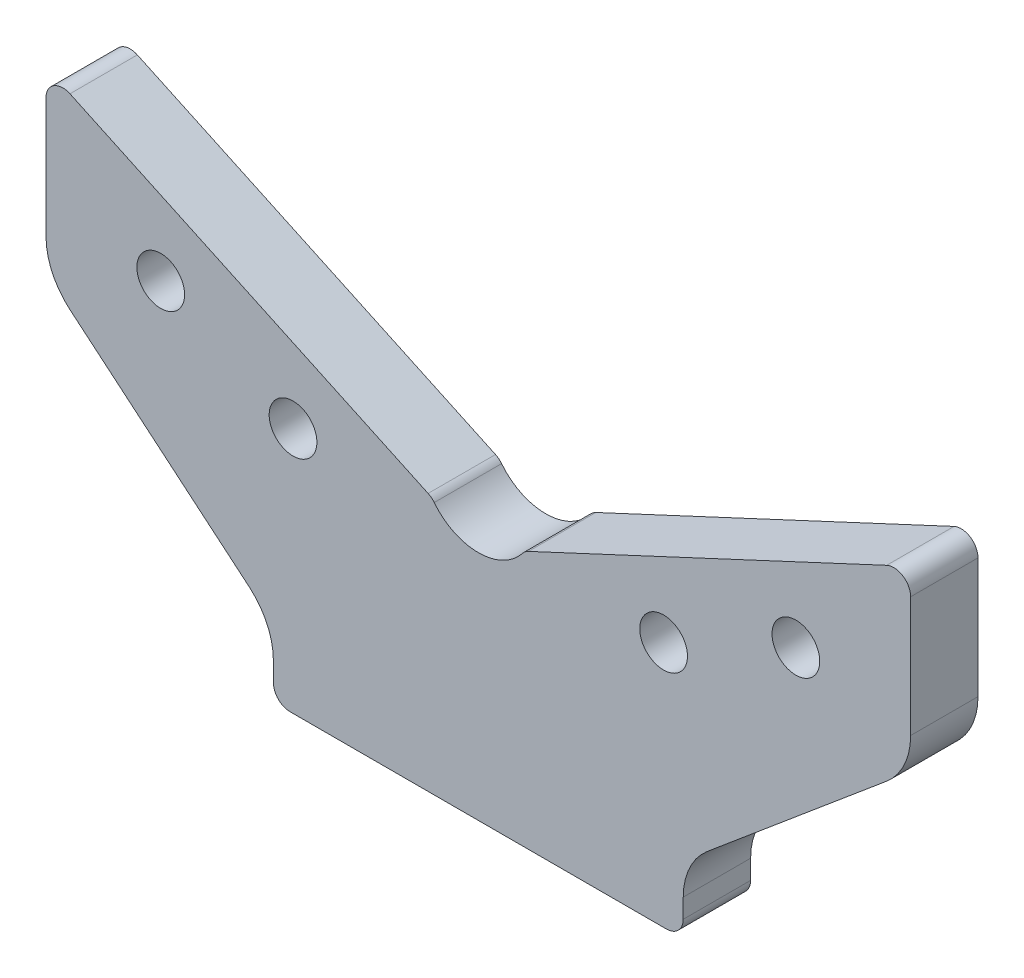
ISO-10303-21;
HEADER;
FILE_DESCRIPTION(('STEP AP214'),'2;1');
FILE_NAME('part.step','',(''),(''),'','','');
FILE_SCHEMA(('AUTOMOTIVE_DESIGN { 1 0 10303 214 1 1 1 1 }'));
ENDSEC;
DATA;
#1=APPLICATION_CONTEXT('core data for automotive mechanical design processes');
#2=APPLICATION_PROTOCOL_DEFINITION('international standard','automotive_design',2000,#1);
#3=PRODUCT_CONTEXT('',#1,'mechanical');
#4=PRODUCT('Part','Part','',(#3));
#5=PRODUCT_RELATED_PRODUCT_CATEGORY('part','',(#4));
#6=PRODUCT_DEFINITION_FORMATION('','',#4);
#7=PRODUCT_DEFINITION_CONTEXT('part definition',#1,'design');
#8=PRODUCT_DEFINITION('design','',#6,#7);
#9=PRODUCT_DEFINITION_SHAPE('','',#8);
#10=(LENGTH_UNIT() NAMED_UNIT(*) SI_UNIT(.MILLI.,.METRE.));
#11=(NAMED_UNIT(*) PLANE_ANGLE_UNIT() SI_UNIT($,.RADIAN.));
#12=(NAMED_UNIT(*) SI_UNIT($,.STERADIAN.) SOLID_ANGLE_UNIT());
#13=UNCERTAINTY_MEASURE_WITH_UNIT(LENGTH_MEASURE(1.E-05),#10,'distance_accuracy_value','');
#14=(GEOMETRIC_REPRESENTATION_CONTEXT(3) GLOBAL_UNCERTAINTY_ASSIGNED_CONTEXT((#13)) GLOBAL_UNIT_ASSIGNED_CONTEXT((#10,
#11,#12)) REPRESENTATION_CONTEXT('',''));
#15=CARTESIAN_POINT('',(0.,0.,0.));
#16=DIRECTION('',(0.,0.,1.));
#17=DIRECTION('',(1.,0.,0.));
#18=AXIS2_PLACEMENT_3D('',#15,#16,#17);
#19=CARTESIAN_POINT('',(0.,0.,12.));
#20=DIRECTION('',(0.,1.,0.));
#21=DIRECTION('',(-1.,0.,0.));
#22=AXIS2_PLACEMENT_3D('',#19,#20,#21);
#23=PLANE('',#22);
#24=DIRECTION('',(1.,0.,0.));
#25=VECTOR('',#24,1.);
#26=CARTESIAN_POINT('',(0.,0.,0.));
#27=LINE('',#26,#25);
#28=CARTESIAN_POINT('',(-33.5,0.,0.));
#29=VERTEX_POINT('',#28);
#30=CARTESIAN_POINT('',(33.5,0.,0.));
#31=VERTEX_POINT('',#30);
#32=EDGE_CURVE('E137',#29,#31,#27,.T.);
#33=ORIENTED_EDGE('',*,*,#32,.T.);
#34=DIRECTION('',(0.,0.,-1.));
#35=VECTOR('',#34,1.);
#36=CARTESIAN_POINT('',(33.5,0.,12.));
#37=LINE('',#36,#35);
#38=CARTESIAN_POINT('',(33.5,0.,12.));
#39=VERTEX_POINT('',#38);
#40=EDGE_CURVE('E11',#39,#31,#37,.T.);
#41=ORIENTED_EDGE('',*,*,#40,.F.);
#42=DIRECTION('',(1.,0.,0.));
#43=VECTOR('',#42,1.);
#44=CARTESIAN_POINT('',(0.,0.,12.));
#45=LINE('',#44,#43);
#46=CARTESIAN_POINT('',(-33.5,0.,12.));
#47=VERTEX_POINT('',#46);
#48=EDGE_CURVE('E143',#47,#39,#45,.T.);
#49=ORIENTED_EDGE('',*,*,#48,.F.);
#50=DIRECTION('',(0.,0.,-1.));
#51=VECTOR('',#50,1.);
#52=CARTESIAN_POINT('',(-33.5,0.,12.));
#53=LINE('',#52,#51);
#54=EDGE_CURVE('E213',#47,#29,#53,.T.);
#55=ORIENTED_EDGE('',*,*,#54,.T.);
#56=EDGE_LOOP('',(#33,#41,#49,#55));
#57=FACE_BOUND('',#56,.T.);
#58=ADVANCED_FACE('F47',(#57),#23,.F.);
#59=CARTESIAN_POINT('',(33.5,3.,12.));
#60=DIRECTION('',(0.,0.,-1.));
#61=DIRECTION('',(-1.,0.,0.));
#62=AXIS2_PLACEMENT_3D('',#59,#60,#61);
#63=CYLINDRICAL_SURFACE('',#62,3.);
#64=CARTESIAN_POINT('',(33.5,3.,0.));
#65=DIRECTION('',(0.,0.,1.));
#66=DIRECTION('',(-1.,0.,0.));
#67=AXIS2_PLACEMENT_3D('',#64,#65,#66);
#68=CIRCLE('',#67,3.);
#69=CARTESIAN_POINT('',(36.5,3.00000000000002,0.));
#70=VERTEX_POINT('',#69);
#71=EDGE_CURVE('E218',#31,#70,#68,.T.);
#72=ORIENTED_EDGE('',*,*,#71,.T.);
#73=DIRECTION('',(0.,0.,-1.));
#74=VECTOR('',#73,1.);
#75=CARTESIAN_POINT('',(36.5,3.00000000000002,12.));
#76=LINE('',#75,#74);
#77=CARTESIAN_POINT('',(36.5,3.00000000000002,12.));
#78=VERTEX_POINT('',#77);
#79=EDGE_CURVE('E56',#78,#70,#76,.T.);
#80=ORIENTED_EDGE('',*,*,#79,.F.);
#81=CARTESIAN_POINT('',(33.5,3.,12.));
#82=DIRECTION('',(0.,0.,1.));
#83=DIRECTION('',(-1.,0.,0.));
#84=AXIS2_PLACEMENT_3D('',#81,#82,#83);
#85=CIRCLE('',#84,3.);
#86=EDGE_CURVE('E327',#39,#78,#85,.T.);
#87=ORIENTED_EDGE('',*,*,#86,.F.);
#88=ORIENTED_EDGE('',*,*,#40,.T.);
#89=EDGE_LOOP('',(#72,#80,#87,#88));
#90=FACE_BOUND('',#89,.T.);
#91=ADVANCED_FACE('F373',(#90),#63,.T.);
#92=CARTESIAN_POINT('',(36.5,6.42077303946028,12.));
#93=DIRECTION('',(-1.,0.,0.));
#94=DIRECTION('',(0.,0.,1.));
#95=AXIS2_PLACEMENT_3D('',#92,#93,#94);
#96=PLANE('',#95);
#97=DIRECTION('',(0.,1.,0.));
#98=VECTOR('',#97,1.);
#99=CARTESIAN_POINT('',(36.5,6.42077303946028,0.));
#100=LINE('',#99,#98);
#101=CARTESIAN_POINT('',(36.5,6.42077303946028,0.));
#102=VERTEX_POINT('',#101);
#103=EDGE_CURVE('E221',#70,#102,#100,.T.);
#104=ORIENTED_EDGE('',*,*,#103,.T.);
#105=DIRECTION('',(0.,0.,-1.));
#106=VECTOR('',#105,1.);
#107=CARTESIAN_POINT('',(36.5,6.42077303946028,12.));
#108=LINE('',#107,#106);
#109=CARTESIAN_POINT('',(36.5,6.42077303946028,12.));
#110=VERTEX_POINT('',#109);
#111=EDGE_CURVE('E298',#110,#102,#108,.T.);
#112=ORIENTED_EDGE('',*,*,#111,.F.);
#113=DIRECTION('',(0.,1.,0.));
#114=VECTOR('',#113,1.);
#115=CARTESIAN_POINT('',(36.5,6.42077303946028,12.));
#116=LINE('',#115,#114);
#117=EDGE_CURVE('E329',#78,#110,#116,.T.);
#118=ORIENTED_EDGE('',*,*,#117,.F.);
#119=ORIENTED_EDGE('',*,*,#79,.T.);
#120=EDGE_LOOP('',(#104,#112,#118,#119));
#121=FACE_BOUND('',#120,.T.);
#122=ADVANCED_FACE('F379',(#121),#96,.F.);
#123=CARTESIAN_POINT('',(48.5,6.42077303946028,12.));
#124=DIRECTION('',(0.,0.,-1.));
#125=DIRECTION('',(-1.,0.,0.));
#126=AXIS2_PLACEMENT_3D('',#123,#124,#125);
#127=CYLINDRICAL_SURFACE('',#126,12.);
#128=CARTESIAN_POINT('',(48.5,6.42077303946028,0.));
#129=DIRECTION('',(0.,0.,-1.));
#130=DIRECTION('',(1.,0.,0.));
#131=AXIS2_PLACEMENT_3D('',#128,#129,#130);
#132=CIRCLE('',#131,12.);
#133=CARTESIAN_POINT('',(40.7865486837615,15.613306356888,0.));
#134=VERTEX_POINT('',#133);
#135=EDGE_CURVE('E223',#102,#134,#132,.T.);
#136=ORIENTED_EDGE('',*,*,#135,.T.);
#137=DIRECTION('',(0.,0.,-1.));
#138=VECTOR('',#137,1.);
#139=CARTESIAN_POINT('',(40.7865486837615,15.613306356888,12.));
#140=LINE('',#139,#138);
#141=CARTESIAN_POINT('',(40.7865486837615,15.613306356888,12.));
#142=VERTEX_POINT('',#141);
#143=EDGE_CURVE('E295',#142,#134,#140,.T.);
#144=ORIENTED_EDGE('',*,*,#143,.F.);
#145=CARTESIAN_POINT('',(48.5,6.42077303946028,12.));
#146=DIRECTION('',(0.,0.,-1.));
#147=DIRECTION('',(1.,0.,0.));
#148=AXIS2_PLACEMENT_3D('',#145,#146,#147);
#149=CIRCLE('',#148,12.);
#150=EDGE_CURVE('E331',#110,#142,#149,.T.);
#151=ORIENTED_EDGE('',*,*,#150,.F.);
#152=ORIENTED_EDGE('',*,*,#111,.T.);
#153=EDGE_LOOP('',(#136,#144,#151,#152));
#154=FACE_BOUND('',#153,.T.);
#155=ADVANCED_FACE('F383',(#154),#127,.F.);
#156=CARTESIAN_POINT('',(40.7865486837615,15.613306356888,12.));
#157=DIRECTION('',(-0.642787609686538,0.766044443118979,0.));
#158=DIRECTION('',(-0.766044443118979,-0.642787609686538,0.));
#159=AXIS2_PLACEMENT_3D('',#156,#157,#158);
#160=PLANE('',#159);
#161=DIRECTION('',(0.766044443118979,0.642787609686538,0.));
#162=VECTOR('',#161,1.);
#163=CARTESIAN_POINT('',(40.7865486837615,15.613306356888,0.));
#164=LINE('',#163,#162);
#165=CARTESIAN_POINT('',(72.7134513162385,42.4031585804323,0.));
#166=VERTEX_POINT('',#165);
#167=EDGE_CURVE('E225',#134,#166,#164,.T.);
#168=ORIENTED_EDGE('',*,*,#167,.T.);
#169=DIRECTION('',(0.,0.,-1.));
#170=VECTOR('',#169,1.);
#171=CARTESIAN_POINT('',(72.7134513162385,42.4031585804323,12.));
#172=LINE('',#171,#170);
#173=CARTESIAN_POINT('',(72.7134513162385,42.4031585804323,12.));
#174=VERTEX_POINT('',#173);
#175=EDGE_CURVE('E292',#174,#166,#172,.T.);
#176=ORIENTED_EDGE('',*,*,#175,.F.);
#177=DIRECTION('',(0.766044443118979,0.642787609686538,0.));
#178=VECTOR('',#177,1.);
#179=CARTESIAN_POINT('',(40.7865486837615,15.613306356888,12.));
#180=LINE('',#179,#178);
#181=EDGE_CURVE('E333',#142,#174,#180,.T.);
#182=ORIENTED_EDGE('',*,*,#181,.F.);
#183=ORIENTED_EDGE('',*,*,#143,.T.);
#184=EDGE_LOOP('',(#168,#176,#182,#183));
#185=FACE_BOUND('',#184,.T.);
#186=ADVANCED_FACE('F388',(#185),#160,.F.);
#187=CARTESIAN_POINT('',(65.,51.59569189786,12.));
#188=DIRECTION('',(0.,0.,-1.));
#189=DIRECTION('',(-1.,0.,0.));
#190=AXIS2_PLACEMENT_3D('',#187,#188,#189);
#191=CYLINDRICAL_SURFACE('',#190,12.);
#192=CARTESIAN_POINT('',(65.,51.59569189786,0.));
#193=DIRECTION('',(0.,0.,1.));
#194=DIRECTION('',(1.,0.,0.));
#195=AXIS2_PLACEMENT_3D('',#192,#193,#194);
#196=CIRCLE('',#195,12.);
#197=CARTESIAN_POINT('',(77.,51.59569189786,0.));
#198=VERTEX_POINT('',#197);
#199=EDGE_CURVE('E227',#166,#198,#196,.T.);
#200=ORIENTED_EDGE('',*,*,#199,.T.);
#201=DIRECTION('',(0.,0.,-1.));
#202=VECTOR('',#201,1.);
#203=CARTESIAN_POINT('',(77.,51.59569189786,12.));
#204=LINE('',#203,#202);
#205=CARTESIAN_POINT('',(77.,51.59569189786,12.));
#206=VERTEX_POINT('',#205);
#207=EDGE_CURVE('E289',#206,#198,#204,.T.);
#208=ORIENTED_EDGE('',*,*,#207,.F.);
#209=CARTESIAN_POINT('',(65.,51.59569189786,12.));
#210=DIRECTION('',(0.,0.,1.));
#211=DIRECTION('',(1.,0.,0.));
#212=AXIS2_PLACEMENT_3D('',#209,#210,#211);
#213=CIRCLE('',#212,12.);
#214=EDGE_CURVE('E335',#174,#206,#213,.T.);
#215=ORIENTED_EDGE('',*,*,#214,.F.);
#216=ORIENTED_EDGE('',*,*,#175,.T.);
#217=EDGE_LOOP('',(#200,#208,#215,#216));
#218=FACE_BOUND('',#217,.T.);
#219=ADVANCED_FACE('F394',(#218),#191,.T.);
#220=CARTESIAN_POINT('',(77.,51.59569189786,12.));
#221=DIRECTION('',(-1.,0.,0.));
#222=DIRECTION('',(0.,0.,1.));
#223=AXIS2_PLACEMENT_3D('',#220,#221,#222);
#224=PLANE('',#223);
#225=DIRECTION('',(0.,1.,0.));
#226=VECTOR('',#225,1.);
#227=CARTESIAN_POINT('',(77.,51.59569189786,0.));
#228=LINE('',#227,#226);
#229=CARTESIAN_POINT('',(77.,73.,0.));
#230=VERTEX_POINT('',#229);
#231=EDGE_CURVE('E229',#198,#230,#228,.T.);
#232=ORIENTED_EDGE('',*,*,#231,.T.);
#233=DIRECTION('',(0.,0.,-1.));
#234=VECTOR('',#233,1.);
#235=CARTESIAN_POINT('',(77.,73.,12.));
#236=LINE('',#235,#234);
#237=CARTESIAN_POINT('',(77.,73.,12.));
#238=VERTEX_POINT('',#237);
#239=EDGE_CURVE('E286',#238,#230,#236,.T.);
#240=ORIENTED_EDGE('',*,*,#239,.F.);
#241=DIRECTION('',(0.,1.,0.));
#242=VECTOR('',#241,1.);
#243=CARTESIAN_POINT('',(77.,51.59569189786,12.));
#244=LINE('',#243,#242);
#245=EDGE_CURVE('E337',#206,#238,#244,.T.);
#246=ORIENTED_EDGE('',*,*,#245,.F.);
#247=ORIENTED_EDGE('',*,*,#207,.T.);
#248=EDGE_LOOP('',(#232,#240,#246,#247));
#249=FACE_BOUND('',#248,.T.);
#250=ADVANCED_FACE('F398',(#249),#224,.F.);
#251=CARTESIAN_POINT('',(74.,73.,12.));
#252=DIRECTION('',(0.,0.,-1.));
#253=DIRECTION('',(-1.,0.,0.));
#254=AXIS2_PLACEMENT_3D('',#251,#252,#253);
#255=CYLINDRICAL_SURFACE('',#254,3.);
#256=CARTESIAN_POINT('',(74.,73.,0.));
#257=DIRECTION('',(0.,0.,1.));
#258=DIRECTION('',(-1.,0.,0.));
#259=AXIS2_PLACEMENT_3D('',#256,#257,#258);
#260=CIRCLE('',#259,3.);
#261=CARTESIAN_POINT('',(72.7321452147779,75.7189233611099,0.));
#262=VERTEX_POINT('',#261);
#263=EDGE_CURVE('E231',#230,#262,#260,.T.);
#264=ORIENTED_EDGE('',*,*,#263,.T.);
#265=DIRECTION('',(0.,0.,-1.));
#266=VECTOR('',#265,1.);
#267=CARTESIAN_POINT('',(72.7321452147779,75.7189233611099,12.));
#268=LINE('',#267,#266);
#269=CARTESIAN_POINT('',(72.7321452147779,75.7189233611099,12.));
#270=VERTEX_POINT('',#269);
#271=EDGE_CURVE('E283',#270,#262,#268,.T.);
#272=ORIENTED_EDGE('',*,*,#271,.F.);
#273=CARTESIAN_POINT('',(74.,73.,12.));
#274=DIRECTION('',(0.,0.,1.));
#275=DIRECTION('',(-1.,0.,0.));
#276=AXIS2_PLACEMENT_3D('',#273,#274,#275);
#277=CIRCLE('',#276,3.);
#278=EDGE_CURVE('E339',#238,#270,#277,.T.);
#279=ORIENTED_EDGE('',*,*,#278,.F.);
#280=ORIENTED_EDGE('',*,*,#239,.T.);
#281=EDGE_LOOP('',(#264,#272,#279,#280));
#282=FACE_BOUND('',#281,.T.);
#283=ADVANCED_FACE('F403',(#282),#255,.T.);
#284=CARTESIAN_POINT('',(72.7321452147779,75.7189233611099,12.));
#285=DIRECTION('',(0.422618261740705,-0.906307787036648,0.));
#286=DIRECTION('',(0.906307787036648,0.422618261740705,0.));
#287=AXIS2_PLACEMENT_3D('',#284,#285,#286);
#288=PLANE('',#287);
#289=DIRECTION('',(-0.906307787036647,-0.422618261740705,0.));
#290=VECTOR('',#289,1.);
#291=CARTESIAN_POINT('',(72.7321452147779,75.7189233611099,0.));
#292=LINE('',#291,#290);
#293=CARTESIAN_POINT('',(8.93961735786246,45.9719790883638,0.));
#294=VERTEX_POINT('',#293);
#295=EDGE_CURVE('E233',#262,#294,#292,.T.);
#296=ORIENTED_EDGE('',*,*,#295,.T.);
#297=DIRECTION('',(0.,0.,-1.));
#298=VECTOR('',#297,1.);
#299=CARTESIAN_POINT('',(8.93961735786246,45.9719790883638,12.));
#300=LINE('',#299,#298);
#301=CARTESIAN_POINT('',(8.93961735786246,45.9719790883638,12.));
#302=VERTEX_POINT('',#301);
#303=EDGE_CURVE('E280',#302,#294,#300,.T.);
#304=ORIENTED_EDGE('',*,*,#303,.F.);
#305=DIRECTION('',(-0.906307787036647,-0.422618261740705,0.));
#306=VECTOR('',#305,1.);
#307=CARTESIAN_POINT('',(72.7321452147779,75.7189233611099,12.));
#308=LINE('',#307,#306);
#309=EDGE_CURVE('E341',#270,#302,#308,.T.);
#310=ORIENTED_EDGE('',*,*,#309,.F.);
#311=ORIENTED_EDGE('',*,*,#271,.T.);
#312=EDGE_LOOP('',(#296,#304,#310,#311));
#313=FACE_BOUND('',#312,.T.);
#314=ADVANCED_FACE('F409',(#313),#288,.F.);
#315=CARTESIAN_POINT('',(10.2074721430846,43.2530557272538,12.));
#316=DIRECTION('',(0.,0.,-1.));
#317=DIRECTION('',(-1.,0.,0.));
#318=AXIS2_PLACEMENT_3D('',#315,#316,#317);
#319=CYLINDRICAL_SURFACE('',#318,3.00000000000001);
#320=CARTESIAN_POINT('',(10.2074721430846,43.2530557272538,0.));
#321=DIRECTION('',(0.,0.,1.));
#322=DIRECTION('',(-1.,0.,0.));
#323=AXIS2_PLACEMENT_3D('',#320,#321,#322);
#324=CIRCLE('',#323,3.00000000000001);
#325=CARTESIAN_POINT('',(7.85190164852659,45.1108198794453,0.));
#326=VERTEX_POINT('',#325);
#327=EDGE_CURVE('E235',#294,#326,#324,.T.);
#328=ORIENTED_EDGE('',*,*,#327,.T.);
#329=DIRECTION('',(0.,0.,-1.));
#330=VECTOR('',#329,1.);
#331=CARTESIAN_POINT('',(7.85190164852659,45.1108198794453,12.));
#332=LINE('',#331,#330);
#333=CARTESIAN_POINT('',(7.85190164852659,45.1108198794453,12.));
#334=VERTEX_POINT('',#333);
#335=EDGE_CURVE('E277',#334,#326,#332,.T.);
#336=ORIENTED_EDGE('',*,*,#335,.F.);
#337=CARTESIAN_POINT('',(10.2074721430846,43.2530557272538,12.));
#338=DIRECTION('',(0.,0.,1.));
#339=DIRECTION('',(-1.,0.,0.));
#340=AXIS2_PLACEMENT_3D('',#337,#338,#339);
#341=CIRCLE('',#340,3.00000000000001);
#342=EDGE_CURVE('E343',#302,#334,#341,.T.);
#343=ORIENTED_EDGE('',*,*,#342,.F.);
#344=ORIENTED_EDGE('',*,*,#303,.T.);
#345=EDGE_LOOP('',(#328,#336,#343,#344));
#346=FACE_BOUND('',#345,.T.);
#347=ADVANCED_FACE('F413',(#346),#319,.T.);
#348=CARTESIAN_POINT('',(0.,51.303367053417,12.));
#349=DIRECTION('',(0.,0.,-1.));
#350=DIRECTION('',(-1.,0.,0.));
#351=AXIS2_PLACEMENT_3D('',#348,#349,#350);
#352=CYLINDRICAL_SURFACE('',#351,10.);
#353=CARTESIAN_POINT('',(0.,51.303367053417,0.));
#354=DIRECTION('',(0.,0.,-1.));
#355=DIRECTION('',(1.,0.,0.));
#356=AXIS2_PLACEMENT_3D('',#353,#354,#355);
#357=CIRCLE('',#356,10.);
#358=CARTESIAN_POINT('',(-7.8519016485266,45.1108198794453,0.));
#359=VERTEX_POINT('',#358);
#360=EDGE_CURVE('E237',#326,#359,#357,.T.);
#361=ORIENTED_EDGE('',*,*,#360,.T.);
#362=DIRECTION('',(0.,0.,-1.));
#363=VECTOR('',#362,1.);
#364=CARTESIAN_POINT('',(-7.8519016485266,45.1108198794453,12.));
#365=LINE('',#364,#363);
#366=CARTESIAN_POINT('',(-7.8519016485266,45.1108198794453,12.));
#367=VERTEX_POINT('',#366);
#368=EDGE_CURVE('E274',#367,#359,#365,.T.);
#369=ORIENTED_EDGE('',*,*,#368,.F.);
#370=CARTESIAN_POINT('',(0.,51.303367053417,12.));
#371=DIRECTION('',(0.,0.,-1.));
#372=DIRECTION('',(1.,0.,0.));
#373=AXIS2_PLACEMENT_3D('',#370,#371,#372);
#374=CIRCLE('',#373,10.);
#375=EDGE_CURVE('E345',#334,#367,#374,.T.);
#376=ORIENTED_EDGE('',*,*,#375,.F.);
#377=ORIENTED_EDGE('',*,*,#335,.T.);
#378=EDGE_LOOP('',(#361,#369,#376,#377));
#379=FACE_BOUND('',#378,.T.);
#380=ADVANCED_FACE('F418',(#379),#352,.F.);
#381=CARTESIAN_POINT('',(-10.2074721430846,43.2530557272538,12.));
#382=DIRECTION('',(0.,0.,-1.));
#383=DIRECTION('',(-1.,0.,0.));
#384=AXIS2_PLACEMENT_3D('',#381,#382,#383);
#385=CYLINDRICAL_SURFACE('',#384,3.00000000000001);
#386=CARTESIAN_POINT('',(-10.2074721430846,43.2530557272538,0.));
#387=DIRECTION('',(0.,0.,1.));
#388=DIRECTION('',(1.,0.,0.));
#389=AXIS2_PLACEMENT_3D('',#386,#387,#388);
#390=CIRCLE('',#389,3.00000000000001);
#391=CARTESIAN_POINT('',(-8.93961735786246,45.9719790883637,0.));
#392=VERTEX_POINT('',#391);
#393=EDGE_CURVE('E239',#359,#392,#390,.T.);
#394=ORIENTED_EDGE('',*,*,#393,.T.);
#395=DIRECTION('',(0.,0.,-1.));
#396=VECTOR('',#395,1.);
#397=CARTESIAN_POINT('',(-8.93961735786246,45.9719790883637,12.));
#398=LINE('',#397,#396);
#399=CARTESIAN_POINT('',(-8.93961735786246,45.9719790883637,12.));
#400=VERTEX_POINT('',#399);
#401=EDGE_CURVE('E271',#400,#392,#398,.T.);
#402=ORIENTED_EDGE('',*,*,#401,.F.);
#403=CARTESIAN_POINT('',(-10.2074721430846,43.2530557272538,12.));
#404=DIRECTION('',(0.,0.,1.));
#405=DIRECTION('',(1.,0.,0.));
#406=AXIS2_PLACEMENT_3D('',#403,#404,#405);
#407=CIRCLE('',#406,3.00000000000001);
#408=EDGE_CURVE('E347',#367,#400,#407,.T.);
#409=ORIENTED_EDGE('',*,*,#408,.F.);
#410=ORIENTED_EDGE('',*,*,#368,.T.);
#411=EDGE_LOOP('',(#394,#402,#409,#410));
#412=FACE_BOUND('',#411,.T.);
#413=ADVANCED_FACE('F424',(#412),#385,.T.);
#414=CARTESIAN_POINT('',(-72.7321452147779,75.7189233611099,12.));
#415=DIRECTION('',(-0.422618261740705,-0.906307787036648,0.));
#416=DIRECTION('',(0.906307787036648,-0.422618261740705,0.));
#417=AXIS2_PLACEMENT_3D('',#414,#415,#416);
#418=PLANE('',#417);
#419=DIRECTION('',(-0.906307787036647,0.422618261740705,0.));
#420=VECTOR('',#419,1.);
#421=CARTESIAN_POINT('',(-72.7321452147779,75.7189233611099,0.));
#422=LINE('',#421,#420);
#423=CARTESIAN_POINT('',(-72.7321452147779,75.7189233611099,0.));
#424=VERTEX_POINT('',#423);
#425=EDGE_CURVE('E241',#392,#424,#422,.T.);
#426=ORIENTED_EDGE('',*,*,#425,.T.);
#427=DIRECTION('',(0.,0.,-1.));
#428=VECTOR('',#427,1.);
#429=CARTESIAN_POINT('',(-72.7321452147779,75.7189233611099,12.));
#430=LINE('',#429,#428);
#431=CARTESIAN_POINT('',(-72.7321452147779,75.7189233611099,12.));
#432=VERTEX_POINT('',#431);
#433=EDGE_CURVE('E268',#432,#424,#430,.T.);
#434=ORIENTED_EDGE('',*,*,#433,.F.);
#435=DIRECTION('',(-0.906307787036647,0.422618261740705,0.));
#436=VECTOR('',#435,1.);
#437=CARTESIAN_POINT('',(-72.7321452147779,75.7189233611099,12.));
#438=LINE('',#437,#436);
#439=EDGE_CURVE('E349',#400,#432,#438,.T.);
#440=ORIENTED_EDGE('',*,*,#439,.F.);
#441=ORIENTED_EDGE('',*,*,#401,.T.);
#442=EDGE_LOOP('',(#426,#434,#440,#441));
#443=FACE_BOUND('',#442,.T.);
#444=ADVANCED_FACE('F428',(#443),#418,.F.);
#445=CARTESIAN_POINT('',(-74.,73.,12.));
#446=DIRECTION('',(0.,0.,-1.));
#447=DIRECTION('',(-1.,0.,0.));
#448=AXIS2_PLACEMENT_3D('',#445,#446,#447);
#449=CYLINDRICAL_SURFACE('',#448,3.);
#450=CARTESIAN_POINT('',(-74.,73.,0.));
#451=DIRECTION('',(0.,0.,1.));
#452=DIRECTION('',(-1.,0.,0.));
#453=AXIS2_PLACEMENT_3D('',#450,#451,#452);
#454=CIRCLE('',#453,3.);
#455=CARTESIAN_POINT('',(-77.,73.,0.));
#456=VERTEX_POINT('',#455);
#457=EDGE_CURVE('E243',#424,#456,#454,.T.);
#458=ORIENTED_EDGE('',*,*,#457,.T.);
#459=DIRECTION('',(0.,0.,-1.));
#460=VECTOR('',#459,1.);
#461=CARTESIAN_POINT('',(-77.,73.,12.));
#462=LINE('',#461,#460);
#463=CARTESIAN_POINT('',(-77.,73.,12.));
#464=VERTEX_POINT('',#463);
#465=EDGE_CURVE('E265',#464,#456,#462,.T.);
#466=ORIENTED_EDGE('',*,*,#465,.F.);
#467=CARTESIAN_POINT('',(-74.,73.,12.));
#468=DIRECTION('',(0.,0.,1.));
#469=DIRECTION('',(-1.,0.,0.));
#470=AXIS2_PLACEMENT_3D('',#467,#468,#469);
#471=CIRCLE('',#470,3.);
#472=EDGE_CURVE('E351',#432,#464,#471,.T.);
#473=ORIENTED_EDGE('',*,*,#472,.F.);
#474=ORIENTED_EDGE('',*,*,#433,.T.);
#475=EDGE_LOOP('',(#458,#466,#473,#474));
#476=FACE_BOUND('',#475,.T.);
#477=ADVANCED_FACE('F433',(#476),#449,.T.);
#478=CARTESIAN_POINT('',(-77.,51.59569189786,12.));
#479=DIRECTION('',(1.,0.,0.));
#480=DIRECTION('',(0.,0.,-1.));
#481=AXIS2_PLACEMENT_3D('',#478,#479,#480);
#482=PLANE('',#481);
#483=DIRECTION('',(0.,-1.,0.));
#484=VECTOR('',#483,1.);
#485=CARTESIAN_POINT('',(-77.,51.59569189786,0.));
#486=LINE('',#485,#484);
#487=CARTESIAN_POINT('',(-77.,51.59569189786,0.));
#488=VERTEX_POINT('',#487);
#489=EDGE_CURVE('E245',#456,#488,#486,.T.);
#490=ORIENTED_EDGE('',*,*,#489,.T.);
#491=DIRECTION('',(0.,0.,-1.));
#492=VECTOR('',#491,1.);
#493=CARTESIAN_POINT('',(-77.,51.59569189786,12.));
#494=LINE('',#493,#492);
#495=CARTESIAN_POINT('',(-77.,51.59569189786,12.));
#496=VERTEX_POINT('',#495);
#497=EDGE_CURVE('E262',#496,#488,#494,.T.);
#498=ORIENTED_EDGE('',*,*,#497,.F.);
#499=DIRECTION('',(0.,-1.,0.));
#500=VECTOR('',#499,1.);
#501=CARTESIAN_POINT('',(-77.,51.59569189786,12.));
#502=LINE('',#501,#500);
#503=EDGE_CURVE('E353',#464,#496,#502,.T.);
#504=ORIENTED_EDGE('',*,*,#503,.F.);
#505=ORIENTED_EDGE('',*,*,#465,.T.);
#506=EDGE_LOOP('',(#490,#498,#504,#505));
#507=FACE_BOUND('',#506,.T.);
#508=ADVANCED_FACE('F436',(#507),#482,.F.);
#509=CARTESIAN_POINT('',(-65.,51.59569189786,12.));
#510=DIRECTION('',(0.,0.,-1.));
#511=DIRECTION('',(-1.,0.,0.));
#512=AXIS2_PLACEMENT_3D('',#509,#510,#511);
#513=CYLINDRICAL_SURFACE('',#512,12.);
#514=CARTESIAN_POINT('',(-65.,51.59569189786,0.));
#515=DIRECTION('',(0.,0.,1.));
#516=DIRECTION('',(-1.,0.,0.));
#517=AXIS2_PLACEMENT_3D('',#514,#515,#516);
#518=CIRCLE('',#517,12.);
#519=CARTESIAN_POINT('',(-72.7134513162385,42.4031585804322,0.));
#520=VERTEX_POINT('',#519);
#521=EDGE_CURVE('E247',#488,#520,#518,.T.);
#522=ORIENTED_EDGE('',*,*,#521,.T.);
#523=DIRECTION('',(0.,0.,-1.));
#524=VECTOR('',#523,1.);
#525=CARTESIAN_POINT('',(-72.7134513162385,42.4031585804322,12.));
#526=LINE('',#525,#524);
#527=CARTESIAN_POINT('',(-72.7134513162385,42.4031585804322,12.));
#528=VERTEX_POINT('',#527);
#529=EDGE_CURVE('E259',#528,#520,#526,.T.);
#530=ORIENTED_EDGE('',*,*,#529,.F.);
#531=CARTESIAN_POINT('',(-65.,51.59569189786,12.));
#532=DIRECTION('',(0.,0.,1.));
#533=DIRECTION('',(-1.,0.,0.));
#534=AXIS2_PLACEMENT_3D('',#531,#532,#533);
#535=CIRCLE('',#534,12.);
#536=EDGE_CURVE('E355',#496,#528,#535,.T.);
#537=ORIENTED_EDGE('',*,*,#536,.F.);
#538=ORIENTED_EDGE('',*,*,#497,.T.);
#539=EDGE_LOOP('',(#522,#530,#537,#538));
#540=FACE_BOUND('',#539,.T.);
#541=ADVANCED_FACE('F361',(#540),#513,.T.);
#542=CARTESIAN_POINT('',(-40.7865486837615,15.613306356888,12.));
#543=DIRECTION('',(0.642787609686538,0.766044443118979,0.));
#544=DIRECTION('',(-0.766044443118979,0.642787609686538,0.));
#545=AXIS2_PLACEMENT_3D('',#542,#543,#544);
#546=PLANE('',#545);
#547=DIRECTION('',(0.766044443118979,-0.642787609686538,0.));
#548=VECTOR('',#547,1.);
#549=CARTESIAN_POINT('',(-40.7865486837615,15.613306356888,0.));
#550=LINE('',#549,#548);
#551=CARTESIAN_POINT('',(-40.7865486837615,15.613306356888,0.));
#552=VERTEX_POINT('',#551);
#553=EDGE_CURVE('E249',#520,#552,#550,.T.);
#554=ORIENTED_EDGE('',*,*,#553,.T.);
#555=DIRECTION('',(0.,0.,-1.));
#556=VECTOR('',#555,1.);
#557=CARTESIAN_POINT('',(-40.7865486837615,15.613306356888,12.));
#558=LINE('',#557,#556);
#559=CARTESIAN_POINT('',(-40.7865486837615,15.613306356888,12.));
#560=VERTEX_POINT('',#559);
#561=EDGE_CURVE('E208',#560,#552,#558,.T.);
#562=ORIENTED_EDGE('',*,*,#561,.F.);
#563=DIRECTION('',(0.766044443118979,-0.642787609686538,0.));
#564=VECTOR('',#563,1.);
#565=CARTESIAN_POINT('',(-40.7865486837615,15.613306356888,12.));
#566=LINE('',#565,#564);
#567=EDGE_CURVE('E199',#528,#560,#566,.T.);
#568=ORIENTED_EDGE('',*,*,#567,.F.);
#569=ORIENTED_EDGE('',*,*,#529,.T.);
#570=EDGE_LOOP('',(#554,#562,#568,#569));
#571=FACE_BOUND('',#570,.T.);
#572=ADVANCED_FACE('F365',(#571),#546,.F.);
#573=CARTESIAN_POINT('',(-48.5,6.42077303946028,12.));
#574=DIRECTION('',(0.,0.,-1.));
#575=DIRECTION('',(-1.,0.,0.));
#576=AXIS2_PLACEMENT_3D('',#573,#574,#575);
#577=CYLINDRICAL_SURFACE('',#576,12.);
#578=CARTESIAN_POINT('',(-48.5,6.42077303946028,0.));
#579=DIRECTION('',(0.,0.,-1.));
#580=DIRECTION('',(-1.,0.,0.));
#581=AXIS2_PLACEMENT_3D('',#578,#579,#580);
#582=CIRCLE('',#581,12.);
#583=CARTESIAN_POINT('',(-36.5,6.42077303946028,0.));
#584=VERTEX_POINT('',#583);
#585=EDGE_CURVE('E207',#552,#584,#582,.T.);
#586=ORIENTED_EDGE('',*,*,#585,.T.);
#587=DIRECTION('',(0.,0.,-1.));
#588=VECTOR('',#587,1.);
#589=CARTESIAN_POINT('',(-36.5,6.42077303946028,12.));
#590=LINE('',#589,#588);
#591=CARTESIAN_POINT('',(-36.5,6.42077303946028,12.));
#592=VERTEX_POINT('',#591);
#593=EDGE_CURVE('E204',#592,#584,#590,.T.);
#594=ORIENTED_EDGE('',*,*,#593,.F.);
#595=CARTESIAN_POINT('',(-48.5,6.42077303946028,12.));
#596=DIRECTION('',(0.,0.,-1.));
#597=DIRECTION('',(-1.,0.,0.));
#598=AXIS2_PLACEMENT_3D('',#595,#596,#597);
#599=CIRCLE('',#598,12.);
#600=EDGE_CURVE('E193',#560,#592,#599,.T.);
#601=ORIENTED_EDGE('',*,*,#600,.F.);
#602=ORIENTED_EDGE('',*,*,#561,.T.);
#603=EDGE_LOOP('',(#586,#594,#601,#602));
#604=FACE_BOUND('',#603,.T.);
#605=ADVANCED_FACE('F205',(#604),#577,.F.);
#606=CARTESIAN_POINT('',(-36.5,6.42077303946028,12.));
#607=DIRECTION('',(1.,0.,0.));
#608=DIRECTION('',(0.,0.,-1.));
#609=AXIS2_PLACEMENT_3D('',#606,#607,#608);
#610=PLANE('',#609);
#611=DIRECTION('',(0.,-1.,0.));
#612=VECTOR('',#611,1.);
#613=CARTESIAN_POINT('',(-36.5,6.42077303946028,0.));
#614=LINE('',#613,#612);
#615=CARTESIAN_POINT('',(-36.5,3.00000000000002,0.));
#616=VERTEX_POINT('',#615);
#617=EDGE_CURVE('E130',#584,#616,#614,.T.);
#618=ORIENTED_EDGE('',*,*,#617,.T.);
#619=DIRECTION('',(0.,0.,-1.));
#620=VECTOR('',#619,1.);
#621=CARTESIAN_POINT('',(-36.5,3.00000000000002,12.));
#622=LINE('',#621,#620);
#623=CARTESIAN_POINT('',(-36.5,3.00000000000002,12.));
#624=VERTEX_POINT('',#623);
#625=EDGE_CURVE('E209',#624,#616,#622,.T.);
#626=ORIENTED_EDGE('',*,*,#625,.F.);
#627=DIRECTION('',(0.,-1.,0.));
#628=VECTOR('',#627,1.);
#629=CARTESIAN_POINT('',(-36.5,6.42077303946028,12.));
#630=LINE('',#629,#628);
#631=EDGE_CURVE('E197',#592,#624,#630,.T.);
#632=ORIENTED_EDGE('',*,*,#631,.F.);
#633=ORIENTED_EDGE('',*,*,#593,.T.);
#634=EDGE_LOOP('',(#618,#626,#632,#633));
#635=FACE_BOUND('',#634,.T.);
#636=ADVANCED_FACE('F211',(#635),#610,.F.);
#637=CARTESIAN_POINT('',(-33.5,2.99999999999999,12.));
#638=DIRECTION('',(0.,0.,-1.));
#639=DIRECTION('',(-1.,0.,0.));
#640=AXIS2_PLACEMENT_3D('',#637,#638,#639);
#641=CYLINDRICAL_SURFACE('',#640,3.);
#642=CARTESIAN_POINT('',(-33.5,2.99999999999999,0.));
#643=DIRECTION('',(0.,0.,1.));
#644=DIRECTION('',(1.,0.,0.));
#645=AXIS2_PLACEMENT_3D('',#642,#643,#644);
#646=CIRCLE('',#645,3.);
#647=EDGE_CURVE('E253',#616,#29,#646,.T.);
#648=ORIENTED_EDGE('',*,*,#647,.T.);
#649=ORIENTED_EDGE('',*,*,#54,.F.);
#650=CARTESIAN_POINT('',(-33.5,2.99999999999999,12.));
#651=DIRECTION('',(0.,0.,1.));
#652=DIRECTION('',(1.,0.,0.));
#653=AXIS2_PLACEMENT_3D('',#650,#651,#652);
#654=CIRCLE('',#653,3.);
#655=EDGE_CURVE('E65',#624,#47,#654,.T.);
#656=ORIENTED_EDGE('',*,*,#655,.F.);
#657=ORIENTED_EDGE('',*,*,#625,.T.);
#658=EDGE_LOOP('',(#648,#649,#656,#657));
#659=FACE_BOUND('',#658,.T.);
#660=ADVANCED_FACE('F368',(#659),#641,.T.);
#661=CARTESIAN_POINT('',(-33.5,2.99999999999999,12.));
#662=DIRECTION('',(0.,0.,1.));
#663=DIRECTION('',(1.,0.,0.));
#664=AXIS2_PLACEMENT_3D('',#661,#662,#663);
#665=PLANE('',#664);
#666=CARTESIAN_POINT('',(-33.,43.9509847449823,12.));
#667=DIRECTION('',(0.,0.,1.));
#668=DIRECTION('',(1.,0.,0.));
#669=AXIS2_PLACEMENT_3D('',#666,#667,#668);
#670=CIRCLE('',#669,4.25);
#671=CARTESIAN_POINT('',(-28.75,43.9509847449823,12.));
#672=VERTEX_POINT('',#671);
#673=EDGE_CURVE('E321',#672,#672,#670,.T.);
#674=ORIENTED_EDGE('',*,*,#673,.F.);
#675=EDGE_LOOP('',(#674));
#676=FACE_BOUND('',#675,.T.);
#677=CARTESIAN_POINT('',(-56.5640024629528,54.9390595502406,12.));
#678=DIRECTION('',(0.,0.,1.));
#679=DIRECTION('',(1.,0.,0.));
#680=AXIS2_PLACEMENT_3D('',#677,#678,#679);
#681=CIRCLE('',#680,4.25);
#682=CARTESIAN_POINT('',(-52.3140024629528,54.9390595502406,12.));
#683=VERTEX_POINT('',#682);
#684=EDGE_CURVE('E311',#683,#683,#681,.T.);
#685=ORIENTED_EDGE('',*,*,#684,.F.);
#686=EDGE_LOOP('',(#685));
#687=FACE_BOUND('',#686,.T.);
#688=CARTESIAN_POINT('',(56.5640024629528,54.9390595502406,12.));
#689=DIRECTION('',(0.,0.,1.));
#690=DIRECTION('',(1.,0.,0.));
#691=AXIS2_PLACEMENT_3D('',#688,#689,#690);
#692=CIRCLE('',#691,4.25);
#693=CARTESIAN_POINT('',(60.8140024629528,54.9390595502406,12.));
#694=VERTEX_POINT('',#693);
#695=EDGE_CURVE('E308',#694,#694,#692,.T.);
#696=ORIENTED_EDGE('',*,*,#695,.F.);
#697=EDGE_LOOP('',(#696));
#698=FACE_BOUND('',#697,.T.);
#699=CARTESIAN_POINT('',(33.,43.9509847449823,12.));
#700=DIRECTION('',(0.,0.,1.));
#701=DIRECTION('',(1.,0.,0.));
#702=AXIS2_PLACEMENT_3D('',#699,#700,#701);
#703=CIRCLE('',#702,4.25);
#704=CARTESIAN_POINT('',(37.25,43.9509847449823,12.));
#705=VERTEX_POINT('',#704);
#706=EDGE_CURVE('E305',#705,#705,#703,.T.);
#707=ORIENTED_EDGE('',*,*,#706,.F.);
#708=EDGE_LOOP('',(#707));
#709=FACE_BOUND('',#708,.T.);
#710=ORIENTED_EDGE('',*,*,#48,.T.);
#711=ORIENTED_EDGE('',*,*,#86,.T.);
#712=ORIENTED_EDGE('',*,*,#117,.T.);
#713=ORIENTED_EDGE('',*,*,#150,.T.);
#714=ORIENTED_EDGE('',*,*,#181,.T.);
#715=ORIENTED_EDGE('',*,*,#214,.T.);
#716=ORIENTED_EDGE('',*,*,#245,.T.);
#717=ORIENTED_EDGE('',*,*,#278,.T.);
#718=ORIENTED_EDGE('',*,*,#309,.T.);
#719=ORIENTED_EDGE('',*,*,#342,.T.);
#720=ORIENTED_EDGE('',*,*,#375,.T.);
#721=ORIENTED_EDGE('',*,*,#408,.T.);
#722=ORIENTED_EDGE('',*,*,#439,.T.);
#723=ORIENTED_EDGE('',*,*,#472,.T.);
#724=ORIENTED_EDGE('',*,*,#503,.T.);
#725=ORIENTED_EDGE('',*,*,#536,.T.);
#726=ORIENTED_EDGE('',*,*,#567,.T.);
#727=ORIENTED_EDGE('',*,*,#600,.T.);
#728=ORIENTED_EDGE('',*,*,#631,.T.);
#729=ORIENTED_EDGE('',*,*,#655,.T.);
#730=EDGE_LOOP('',(#710,#711,#712,#713,#714,#715,#716,#717,#718,#719,#720,#721,#722,#723,#724,
#725,#726,#727,#728,#729));
#731=FACE_BOUND('',#730,.T.);
#732=ADVANCED_FACE('F195',(#676,#687,#698,#709,#731),#665,.T.);
#733=CARTESIAN_POINT('',(-33.5,2.99999999999999,0.));
#734=DIRECTION('',(0.,0.,1.));
#735=DIRECTION('',(1.,0.,0.));
#736=AXIS2_PLACEMENT_3D('',#733,#734,#735);
#737=PLANE('',#736);
#738=CARTESIAN_POINT('',(-33.,43.9509847449823,0.));
#739=DIRECTION('',(0.,0.,1.));
#740=DIRECTION('',(1.,0.,0.));
#741=AXIS2_PLACEMENT_3D('',#738,#739,#740);
#742=CIRCLE('',#741,4.25);
#743=CARTESIAN_POINT('',(-28.75,43.9509847449823,0.));
#744=VERTEX_POINT('',#743);
#745=EDGE_CURVE('E50',#744,#744,#742,.T.);
#746=ORIENTED_EDGE('',*,*,#745,.T.);
#747=EDGE_LOOP('',(#746));
#748=FACE_BOUND('',#747,.T.);
#749=CARTESIAN_POINT('',(-56.5640024629528,54.9390595502406,0.));
#750=DIRECTION('',(0.,0.,1.));
#751=DIRECTION('',(1.,0.,0.));
#752=AXIS2_PLACEMENT_3D('',#749,#750,#751);
#753=CIRCLE('',#752,4.25);
#754=CARTESIAN_POINT('',(-52.3140024629528,54.9390595502406,0.));
#755=VERTEX_POINT('',#754);
#756=EDGE_CURVE('E309',#755,#755,#753,.T.);
#757=ORIENTED_EDGE('',*,*,#756,.T.);
#758=EDGE_LOOP('',(#757));
#759=FACE_BOUND('',#758,.T.);
#760=CARTESIAN_POINT('',(56.5640024629528,54.9390595502406,0.));
#761=DIRECTION('',(0.,0.,1.));
#762=DIRECTION('',(1.,0.,0.));
#763=AXIS2_PLACEMENT_3D('',#760,#761,#762);
#764=CIRCLE('',#763,4.25);
#765=CARTESIAN_POINT('',(60.8140024629528,54.9390595502406,0.));
#766=VERTEX_POINT('',#765);
#767=EDGE_CURVE('E306',#766,#766,#764,.T.);
#768=ORIENTED_EDGE('',*,*,#767,.T.);
#769=EDGE_LOOP('',(#768));
#770=FACE_BOUND('',#769,.T.);
#771=CARTESIAN_POINT('',(33.,43.9509847449823,0.));
#772=DIRECTION('',(0.,0.,1.));
#773=DIRECTION('',(1.,0.,0.));
#774=AXIS2_PLACEMENT_3D('',#771,#772,#773);
#775=CIRCLE('',#774,4.25);
#776=CARTESIAN_POINT('',(37.25,43.9509847449823,0.));
#777=VERTEX_POINT('',#776);
#778=EDGE_CURVE('E219',#777,#777,#775,.T.);
#779=ORIENTED_EDGE('',*,*,#778,.T.);
#780=EDGE_LOOP('',(#779));
#781=FACE_BOUND('',#780,.T.);
#782=ORIENTED_EDGE('',*,*,#32,.F.);
#783=ORIENTED_EDGE('',*,*,#647,.F.);
#784=ORIENTED_EDGE('',*,*,#617,.F.);
#785=ORIENTED_EDGE('',*,*,#585,.F.);
#786=ORIENTED_EDGE('',*,*,#553,.F.);
#787=ORIENTED_EDGE('',*,*,#521,.F.);
#788=ORIENTED_EDGE('',*,*,#489,.F.);
#789=ORIENTED_EDGE('',*,*,#457,.F.);
#790=ORIENTED_EDGE('',*,*,#425,.F.);
#791=ORIENTED_EDGE('',*,*,#393,.F.);
#792=ORIENTED_EDGE('',*,*,#360,.F.);
#793=ORIENTED_EDGE('',*,*,#327,.F.);
#794=ORIENTED_EDGE('',*,*,#295,.F.);
#795=ORIENTED_EDGE('',*,*,#263,.F.);
#796=ORIENTED_EDGE('',*,*,#231,.F.);
#797=ORIENTED_EDGE('',*,*,#199,.F.);
#798=ORIENTED_EDGE('',*,*,#167,.F.);
#799=ORIENTED_EDGE('',*,*,#135,.F.);
#800=ORIENTED_EDGE('',*,*,#103,.F.);
#801=ORIENTED_EDGE('',*,*,#71,.F.);
#802=EDGE_LOOP('',(#782,#783,#784,#785,#786,#787,#788,#789,#790,#791,#792,#793,#794,#795,#796,
#797,#798,#799,#800,#801));
#803=FACE_BOUND('',#802,.T.);
#804=ADVANCED_FACE('F366',(#748,#759,#770,#781,#803),#737,.F.);
#805=CARTESIAN_POINT('',(33.,43.9509847449823,12.));
#806=DIRECTION('',(0.,0.,1.));
#807=DIRECTION('',(1.,0.,0.));
#808=AXIS2_PLACEMENT_3D('',#805,#806,#807);
#809=CYLINDRICAL_SURFACE('',#808,4.25);
#810=ORIENTED_EDGE('',*,*,#706,.T.);
#811=EDGE_LOOP('',(#810));
#812=FACE_BOUND('',#811,.T.);
#813=ORIENTED_EDGE('',*,*,#778,.F.);
#814=EDGE_LOOP('',(#813));
#815=FACE_BOUND('',#814,.T.);
#816=ADVANCED_FACE('F525',(#812,#815),#809,.F.);
#817=CARTESIAN_POINT('',(56.5640024629528,54.9390595502406,12.));
#818=DIRECTION('',(0.,0.,1.));
#819=DIRECTION('',(1.,0.,0.));
#820=AXIS2_PLACEMENT_3D('',#817,#818,#819);
#821=CYLINDRICAL_SURFACE('',#820,4.25);
#822=ORIENTED_EDGE('',*,*,#695,.T.);
#823=EDGE_LOOP('',(#822));
#824=FACE_BOUND('',#823,.T.);
#825=ORIENTED_EDGE('',*,*,#767,.F.);
#826=EDGE_LOOP('',(#825));
#827=FACE_BOUND('',#826,.T.);
#828=ADVANCED_FACE('F534',(#824,#827),#821,.F.);
#829=CARTESIAN_POINT('',(-56.5640024629528,54.9390595502406,12.));
#830=DIRECTION('',(0.,0.,1.));
#831=DIRECTION('',(1.,0.,0.));
#832=AXIS2_PLACEMENT_3D('',#829,#830,#831);
#833=CYLINDRICAL_SURFACE('',#832,4.25);
#834=ORIENTED_EDGE('',*,*,#684,.T.);
#835=EDGE_LOOP('',(#834));
#836=FACE_BOUND('',#835,.T.);
#837=ORIENTED_EDGE('',*,*,#756,.F.);
#838=EDGE_LOOP('',(#837));
#839=FACE_BOUND('',#838,.T.);
#840=ADVANCED_FACE('F544',(#836,#839),#833,.F.);
#841=CARTESIAN_POINT('',(-33.,43.9509847449823,12.));
#842=DIRECTION('',(0.,0.,1.));
#843=DIRECTION('',(1.,0.,0.));
#844=AXIS2_PLACEMENT_3D('',#841,#842,#843);
#845=CYLINDRICAL_SURFACE('',#844,4.25);
#846=ORIENTED_EDGE('',*,*,#673,.T.);
#847=EDGE_LOOP('',(#846));
#848=FACE_BOUND('',#847,.T.);
#849=ORIENTED_EDGE('',*,*,#745,.F.);
#850=EDGE_LOOP('',(#849));
#851=FACE_BOUND('',#850,.T.);
#852=ADVANCED_FACE('F554',(#848,#851),#845,.F.);
#853=CLOSED_SHELL('',(#58,#91,#122,#155,#186,#219,#250,#283,#314,#347,#380,#413,#444,#477,#508,
#541,#572,#605,#636,#660,#732,#804,#816,#828,#840,#852));
#854=MANIFOLD_SOLID_BREP('B2',#853);
#855=ADVANCED_BREP_SHAPE_REPRESENTATION('',(#18,#854),#14);
#856=SHAPE_DEFINITION_REPRESENTATION(#9,#855);
ENDSEC;
END-ISO-10303-21;
